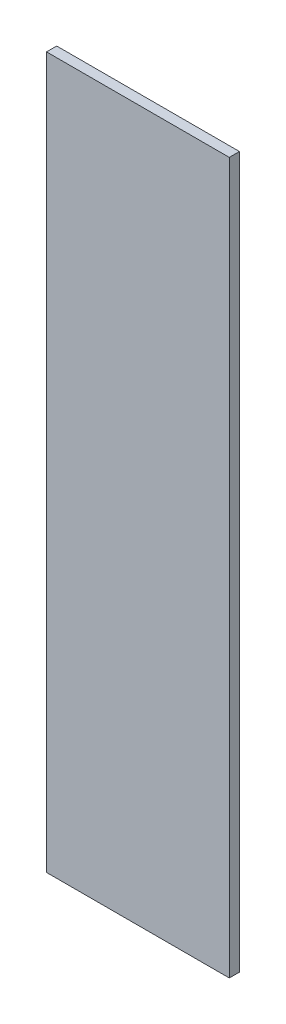
ISO-10303-21;
HEADER;
FILE_DESCRIPTION(('STEP AP214'),'2;1');
FILE_NAME('part.step','',(''),(''),'','','');
FILE_SCHEMA(('AUTOMOTIVE_DESIGN { 1 0 10303 214 1 1 1 1 }'));
ENDSEC;
DATA;
#1=APPLICATION_CONTEXT('core data for automotive mechanical design processes');
#2=APPLICATION_PROTOCOL_DEFINITION('international standard','automotive_design',2000,#1);
#3=PRODUCT_CONTEXT('',#1,'mechanical');
#4=PRODUCT('Part','Part','',(#3));
#5=PRODUCT_RELATED_PRODUCT_CATEGORY('part','',(#4));
#6=PRODUCT_DEFINITION_FORMATION('','',#4);
#7=PRODUCT_DEFINITION_CONTEXT('part definition',#1,'design');
#8=PRODUCT_DEFINITION('design','',#6,#7);
#9=PRODUCT_DEFINITION_SHAPE('','',#8);
#10=(LENGTH_UNIT() NAMED_UNIT(*) SI_UNIT(.MILLI.,.METRE.));
#11=(NAMED_UNIT(*) PLANE_ANGLE_UNIT() SI_UNIT($,.RADIAN.));
#12=(NAMED_UNIT(*) SI_UNIT($,.STERADIAN.) SOLID_ANGLE_UNIT());
#13=UNCERTAINTY_MEASURE_WITH_UNIT(LENGTH_MEASURE(1.E-05),#10,'distance_accuracy_value','');
#14=(GEOMETRIC_REPRESENTATION_CONTEXT(3) GLOBAL_UNCERTAINTY_ASSIGNED_CONTEXT((#13)) GLOBAL_UNIT_ASSIGNED_CONTEXT((#10,
#11,#12)) REPRESENTATION_CONTEXT('',''));
#15=CARTESIAN_POINT('',(0.,0.,0.));
#16=DIRECTION('',(0.,0.,1.));
#17=DIRECTION('',(1.,0.,0.));
#18=AXIS2_PLACEMENT_3D('',#15,#16,#17);
#19=CARTESIAN_POINT('',(45.,175.,-5.));
#20=DIRECTION('',(1.,0.,0.));
#21=DIRECTION('',(0.,1.,0.));
#22=AXIS2_PLACEMENT_3D('',#19,#20,#21);
#23=PLANE('',#22);
#24=DIRECTION('',(0.,1.,0.));
#25=VECTOR('',#24,1.);
#26=CARTESIAN_POINT('',(45.,175.,0.));
#27=LINE('',#26,#25);
#28=CARTESIAN_POINT('',(45.,-175.,0.));
#29=VERTEX_POINT('',#28);
#30=CARTESIAN_POINT('',(45.,175.,0.));
#31=VERTEX_POINT('',#30);
#32=EDGE_CURVE('E103',#29,#31,#27,.T.);
#33=ORIENTED_EDGE('',*,*,#32,.F.);
#34=DIRECTION('',(0.,0.,1.));
#35=VECTOR('',#34,1.);
#36=CARTESIAN_POINT('',(45.,-175.,-5.));
#37=LINE('',#36,#35);
#38=CARTESIAN_POINT('',(45.,-175.,-5.));
#39=VERTEX_POINT('',#38);
#40=EDGE_CURVE('E11',#39,#29,#37,.T.);
#41=ORIENTED_EDGE('',*,*,#40,.F.);
#42=DIRECTION('',(0.,1.,0.));
#43=VECTOR('',#42,1.);
#44=CARTESIAN_POINT('',(45.,175.,-5.));
#45=LINE('',#44,#43);
#46=CARTESIAN_POINT('',(45.,175.,-5.));
#47=VERTEX_POINT('',#46);
#48=EDGE_CURVE('E97',#39,#47,#45,.T.);
#49=ORIENTED_EDGE('',*,*,#48,.T.);
#50=DIRECTION('',(0.,0.,1.));
#51=VECTOR('',#50,1.);
#52=CARTESIAN_POINT('',(45.,175.,-5.));
#53=LINE('',#52,#51);
#54=EDGE_CURVE('E42',#47,#31,#53,.T.);
#55=ORIENTED_EDGE('',*,*,#54,.T.);
#56=EDGE_LOOP('',(#33,#41,#49,#55));
#57=FACE_BOUND('',#56,.T.);
#58=ADVANCED_FACE('F39',(#57),#23,.T.);
#59=CARTESIAN_POINT('',(-45.,-175.,-5.));
#60=DIRECTION('',(0.,-1.,0.));
#61=DIRECTION('',(0.,0.,-1.));
#62=AXIS2_PLACEMENT_3D('',#59,#60,#61);
#63=PLANE('',#62);
#64=DIRECTION('',(1.,0.,0.));
#65=VECTOR('',#64,1.);
#66=CARTESIAN_POINT('',(-45.,-175.,0.));
#67=LINE('',#66,#65);
#68=CARTESIAN_POINT('',(-45.,-175.,0.));
#69=VERTEX_POINT('',#68);
#70=EDGE_CURVE('E99',#69,#29,#67,.T.);
#71=ORIENTED_EDGE('',*,*,#70,.F.);
#72=DIRECTION('',(0.,0.,1.));
#73=VECTOR('',#72,1.);
#74=CARTESIAN_POINT('',(-45.,-175.,-5.));
#75=LINE('',#74,#73);
#76=CARTESIAN_POINT('',(-45.,-175.,-5.));
#77=VERTEX_POINT('',#76);
#78=EDGE_CURVE('E48',#77,#69,#75,.T.);
#79=ORIENTED_EDGE('',*,*,#78,.F.);
#80=DIRECTION('',(1.,0.,0.));
#81=VECTOR('',#80,1.);
#82=CARTESIAN_POINT('',(-45.,-175.,-5.));
#83=LINE('',#82,#81);
#84=EDGE_CURVE('E94',#77,#39,#83,.T.);
#85=ORIENTED_EDGE('',*,*,#84,.T.);
#86=ORIENTED_EDGE('',*,*,#40,.T.);
#87=EDGE_LOOP('',(#71,#79,#85,#86));
#88=FACE_BOUND('',#87,.T.);
#89=ADVANCED_FACE('F113',(#88),#63,.T.);
#90=CARTESIAN_POINT('',(-45.,175.,-5.));
#91=DIRECTION('',(-1.,0.,0.));
#92=DIRECTION('',(0.,-1.,0.));
#93=AXIS2_PLACEMENT_3D('',#90,#91,#92);
#94=PLANE('',#93);
#95=DIRECTION('',(0.,-1.,0.));
#96=VECTOR('',#95,1.);
#97=CARTESIAN_POINT('',(-45.,175.,0.));
#98=LINE('',#97,#96);
#99=CARTESIAN_POINT('',(-45.,175.,0.));
#100=VERTEX_POINT('',#99);
#101=EDGE_CURVE('E89',#100,#69,#98,.T.);
#102=ORIENTED_EDGE('',*,*,#101,.F.);
#103=DIRECTION('',(0.,0.,1.));
#104=VECTOR('',#103,1.);
#105=CARTESIAN_POINT('',(-45.,175.,-5.));
#106=LINE('',#105,#104);
#107=CARTESIAN_POINT('',(-45.,175.,-5.));
#108=VERTEX_POINT('',#107);
#109=EDGE_CURVE('E84',#108,#100,#106,.T.);
#110=ORIENTED_EDGE('',*,*,#109,.F.);
#111=DIRECTION('',(0.,-1.,0.));
#112=VECTOR('',#111,1.);
#113=CARTESIAN_POINT('',(-45.,175.,-5.));
#114=LINE('',#113,#112);
#115=EDGE_CURVE('E87',#108,#77,#114,.T.);
#116=ORIENTED_EDGE('',*,*,#115,.T.);
#117=ORIENTED_EDGE('',*,*,#78,.T.);
#118=EDGE_LOOP('',(#102,#110,#116,#117));
#119=FACE_BOUND('',#118,.T.);
#120=ADVANCED_FACE('F86',(#119),#94,.T.);
#121=CARTESIAN_POINT('',(-45.,175.,-5.));
#122=DIRECTION('',(0.,1.,0.));
#123=DIRECTION('',(0.,0.,1.));
#124=AXIS2_PLACEMENT_3D('',#121,#122,#123);
#125=PLANE('',#124);
#126=DIRECTION('',(-1.,0.,0.));
#127=VECTOR('',#126,1.);
#128=CARTESIAN_POINT('',(-45.,175.,0.));
#129=LINE('',#128,#127);
#130=EDGE_CURVE('E106',#31,#100,#129,.T.);
#131=ORIENTED_EDGE('',*,*,#130,.F.);
#132=ORIENTED_EDGE('',*,*,#54,.F.);
#133=DIRECTION('',(-1.,0.,0.));
#134=VECTOR('',#133,1.);
#135=CARTESIAN_POINT('',(-45.,175.,-5.));
#136=LINE('',#135,#134);
#137=EDGE_CURVE('E93',#47,#108,#136,.T.);
#138=ORIENTED_EDGE('',*,*,#137,.T.);
#139=ORIENTED_EDGE('',*,*,#109,.T.);
#140=EDGE_LOOP('',(#131,#132,#138,#139));
#141=FACE_BOUND('',#140,.T.);
#142=ADVANCED_FACE('F96',(#141),#125,.T.);
#143=CARTESIAN_POINT('',(0.,0.,-5.));
#144=DIRECTION('',(0.,0.,1.));
#145=DIRECTION('',(1.,0.,0.));
#146=AXIS2_PLACEMENT_3D('',#143,#144,#145);
#147=PLANE('',#146);
#148=ORIENTED_EDGE('',*,*,#48,.F.);
#149=ORIENTED_EDGE('',*,*,#84,.F.);
#150=ORIENTED_EDGE('',*,*,#115,.F.);
#151=ORIENTED_EDGE('',*,*,#137,.F.);
#152=EDGE_LOOP('',(#148,#149,#150,#151));
#153=FACE_BOUND('',#152,.T.);
#154=ADVANCED_FACE('F92',(#153),#147,.F.);
#155=CARTESIAN_POINT('',(0.,0.,0.));
#156=DIRECTION('',(0.,0.,1.));
#157=DIRECTION('',(1.,0.,0.));
#158=AXIS2_PLACEMENT_3D('',#155,#156,#157);
#159=PLANE('',#158);
#160=ORIENTED_EDGE('',*,*,#32,.T.);
#161=ORIENTED_EDGE('',*,*,#130,.T.);
#162=ORIENTED_EDGE('',*,*,#101,.T.);
#163=ORIENTED_EDGE('',*,*,#70,.T.);
#164=EDGE_LOOP('',(#160,#161,#162,#163));
#165=FACE_BOUND('',#164,.T.);
#166=ADVANCED_FACE('F112',(#165),#159,.T.);
#167=CLOSED_SHELL('',(#58,#89,#120,#142,#154,#166));
#168=MANIFOLD_SOLID_BREP('B2',#167);
#169=ADVANCED_BREP_SHAPE_REPRESENTATION('',(#18,#168),#14);
#170=SHAPE_DEFINITION_REPRESENTATION(#9,#169);
ENDSEC;
END-ISO-10303-21;
